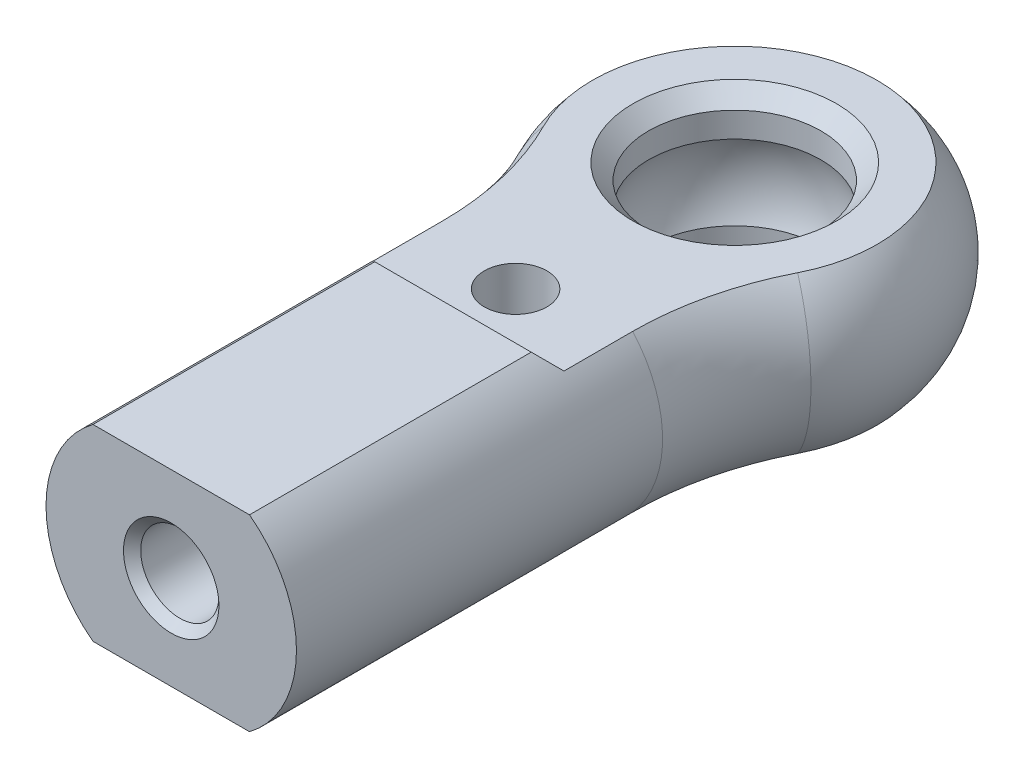
ISO-10303-21;
HEADER;
FILE_DESCRIPTION(('STEP AP214'),'2;1');
FILE_NAME('part.step','',(''),(''),'','','');
FILE_SCHEMA(('AUTOMOTIVE_DESIGN { 1 0 10303 214 1 1 1 1 }'));
ENDSEC;
DATA;
#1=APPLICATION_CONTEXT('core data for automotive mechanical design processes');
#2=APPLICATION_PROTOCOL_DEFINITION('international standard','automotive_design',2000,#1);
#3=PRODUCT_CONTEXT('',#1,'mechanical');
#4=PRODUCT('Part','Part','',(#3));
#5=PRODUCT_RELATED_PRODUCT_CATEGORY('part','',(#4));
#6=PRODUCT_DEFINITION_FORMATION('','',#4);
#7=PRODUCT_DEFINITION_CONTEXT('part definition',#1,'design');
#8=PRODUCT_DEFINITION('design','',#6,#7);
#9=PRODUCT_DEFINITION_SHAPE('','',#8);
#10=(LENGTH_UNIT() NAMED_UNIT(*) SI_UNIT(.MILLI.,.METRE.));
#11=(NAMED_UNIT(*) PLANE_ANGLE_UNIT() SI_UNIT($,.RADIAN.));
#12=(NAMED_UNIT(*) SI_UNIT($,.STERADIAN.) SOLID_ANGLE_UNIT());
#13=UNCERTAINTY_MEASURE_WITH_UNIT(LENGTH_MEASURE(1.E-05),#10,'distance_accuracy_value','');
#14=(GEOMETRIC_REPRESENTATION_CONTEXT(3) GLOBAL_UNCERTAINTY_ASSIGNED_CONTEXT((#13)) GLOBAL_UNIT_ASSIGNED_CONTEXT((#10,
#11,#12)) REPRESENTATION_CONTEXT('',''));
#15=CARTESIAN_POINT('',(0.,0.,0.));
#16=DIRECTION('',(0.,0.,1.));
#17=DIRECTION('',(1.,0.,0.));
#18=AXIS2_PLACEMENT_3D('',#15,#16,#17);
#19=CARTESIAN_POINT('',(-5.5,2.5,8.49999999999999));
#20=DIRECTION('',(0.,-1.,0.));
#21=DIRECTION('',(0.,0.,-1.));
#22=AXIS2_PLACEMENT_3D('',#19,#20,#21);
#23=PLANE('',#22);
#24=CARTESIAN_POINT('',(0.,2.5,0.));
#25=DIRECTION('',(0.,-1.,0.));
#26=DIRECTION('',(0.,0.,-1.));
#27=AXIS2_PLACEMENT_3D('',#24,#25,#26);
#28=CIRCLE('',#27,3.24999999999999);
#29=CARTESIAN_POINT('',(0.,2.5,-3.24999999999999));
#30=VERTEX_POINT('',#29);
#31=EDGE_CURVE('E11',#30,#30,#28,.T.);
#32=ORIENTED_EDGE('',*,*,#31,.T.);
#33=EDGE_LOOP('',(#32));
#34=FACE_BOUND('',#33,.T.);
#35=CARTESIAN_POINT('',(0.,2.5,7.));
#36=DIRECTION('',(0.,-1.,0.));
#37=DIRECTION('',(0.,0.,-1.));
#38=AXIS2_PLACEMENT_3D('',#35,#36,#37);
#39=CIRCLE('',#38,1.);
#40=CARTESIAN_POINT('',(0.,2.5,6.));
#41=VERTEX_POINT('',#40);
#42=EDGE_CURVE('E158',#41,#41,#39,.T.);
#43=ORIENTED_EDGE('',*,*,#42,.T.);
#44=EDGE_LOOP('',(#43));
#45=FACE_BOUND('',#44,.T.);
#46=DIRECTION('',(1.,0.,0.));
#47=VECTOR('',#46,1.);
#48=CARTESIAN_POINT('',(-5.5,2.5,8.49999999999999));
#49=LINE('',#48,#47);
#50=CARTESIAN_POINT('',(-3.04508497187473,2.5,8.49999999999999));
#51=VERTEX_POINT('',#50);
#52=CARTESIAN_POINT('',(3.04508497187474,2.5,8.49999999999999));
#53=VERTEX_POINT('',#52);
#54=EDGE_CURVE('E271',#51,#53,#49,.T.);
#55=ORIENTED_EDGE('',*,*,#54,.T.);
#56=DIRECTION('',(0.,0.,1.));
#57=VECTOR('',#56,1.);
#58=CARTESIAN_POINT('',(3.04508497187474,2.5,6.30476010645924));
#59=LINE('',#58,#57);
#60=CARTESIAN_POINT('',(3.04508497187474,2.5,6.30476010645924));
#61=VERTEX_POINT('',#60);
#62=EDGE_CURVE('E124',#53,#61,#59,.F.);
#63=ORIENTED_EDGE('',*,*,#62,.T.);
#64=CARTESIAN_POINT('',(12.5,2.5,6.30476010645925));
#65=DIRECTION('',(0.,1.,0.));
#66=DIRECTION('',(0.,0.,1.));
#67=AXIS2_PLACEMENT_3D('',#64,#65,#66);
#68=CIRCLE('',#67,9.45491502812527);
#69=CARTESIAN_POINT('',(4.05811158203102,2.5,2.04683360079594));
#70=VERTEX_POINT('',#69);
#71=EDGE_CURVE('E265',#70,#61,#68,.T.);
#72=ORIENTED_EDGE('',*,*,#71,.F.);
#73=CARTESIAN_POINT('',(0.,2.5,0.));
#74=DIRECTION('',(0.,-1.,0.));
#75=DIRECTION('',(0.,0.,-1.));
#76=AXIS2_PLACEMENT_3D('',#73,#74,#75);
#77=CIRCLE('',#76,4.54508497187474);
#78=CARTESIAN_POINT('',(-4.05811158203099,2.5,2.04683360079601));
#79=VERTEX_POINT('',#78);
#80=EDGE_CURVE('E269',#79,#70,#77,.T.);
#81=ORIENTED_EDGE('',*,*,#80,.F.);
#82=CARTESIAN_POINT('',(-12.5,2.5,6.30476010645925));
#83=DIRECTION('',(0.,1.,0.));
#84=DIRECTION('',(0.,0.,1.));
#85=AXIS2_PLACEMENT_3D('',#82,#83,#84);
#86=CIRCLE('',#85,9.45491502812527);
#87=CARTESIAN_POINT('',(-3.04508497187473,2.5,6.30476010645931));
#88=VERTEX_POINT('',#87);
#89=EDGE_CURVE('E277',#88,#79,#86,.T.);
#90=ORIENTED_EDGE('',*,*,#89,.F.);
#91=DIRECTION('',(0.,0.,1.));
#92=VECTOR('',#91,1.);
#93=CARTESIAN_POINT('',(-3.04508497187473,2.5,6.30476010645927));
#94=LINE('',#93,#92);
#95=EDGE_CURVE('E264',#51,#88,#94,.F.);
#96=ORIENTED_EDGE('',*,*,#95,.F.);
#97=EDGE_LOOP('',(#55,#63,#72,#81,#90,#96));
#98=FACE_BOUND('',#97,.T.);
#99=ADVANCED_FACE('F35',(#34,#45,#98),#23,.F.);
#100=CARTESIAN_POINT('',(-5.5,-2.5,8.49999999999999));
#101=DIRECTION('',(0.,-1.,0.));
#102=DIRECTION('',(0.,0.,-1.));
#103=AXIS2_PLACEMENT_3D('',#100,#101,#102);
#104=PLANE('',#103);
#105=CARTESIAN_POINT('',(0.,-2.5,0.));
#106=DIRECTION('',(0.,-1.,0.));
#107=DIRECTION('',(0.,0.,-1.));
#108=AXIS2_PLACEMENT_3D('',#105,#106,#107);
#109=CIRCLE('',#108,3.24999999999999);
#110=CARTESIAN_POINT('',(0.,-2.5,-3.24999999999999));
#111=VERTEX_POINT('',#110);
#112=EDGE_CURVE('E154',#111,#111,#109,.F.);
#113=ORIENTED_EDGE('',*,*,#112,.T.);
#114=EDGE_LOOP('',(#113));
#115=FACE_BOUND('',#114,.T.);
#116=CARTESIAN_POINT('',(0.,-2.5,7.));
#117=DIRECTION('',(0.,-1.,0.));
#118=DIRECTION('',(0.,0.,-1.));
#119=AXIS2_PLACEMENT_3D('',#116,#117,#118);
#120=CIRCLE('',#119,1.);
#121=CARTESIAN_POINT('',(0.,-2.5,6.));
#122=VERTEX_POINT('',#121);
#123=EDGE_CURVE('E155',#122,#122,#120,.T.);
#124=ORIENTED_EDGE('',*,*,#123,.F.);
#125=EDGE_LOOP('',(#124));
#126=FACE_BOUND('',#125,.T.);
#127=DIRECTION('',(0.,0.,1.));
#128=VECTOR('',#127,1.);
#129=CARTESIAN_POINT('',(-3.04508497187473,-2.5,6.30476010645927));
#130=LINE('',#129,#128);
#131=CARTESIAN_POINT('',(-3.04508497187473,-2.5,8.49999999999999));
#132=VERTEX_POINT('',#131);
#133=CARTESIAN_POINT('',(-3.04508497187473,-2.5,6.30476010645931));
#134=VERTEX_POINT('',#133);
#135=EDGE_CURVE('E133',#132,#134,#130,.F.);
#136=ORIENTED_EDGE('',*,*,#135,.T.);
#137=CARTESIAN_POINT('',(-12.5,-2.5,6.30476010645925));
#138=DIRECTION('',(0.,1.,0.));
#139=DIRECTION('',(0.,0.,1.));
#140=AXIS2_PLACEMENT_3D('',#137,#138,#139);
#141=CIRCLE('',#140,9.45491502812527);
#142=CARTESIAN_POINT('',(-4.05811158203099,-2.5,2.04683360079601));
#143=VERTEX_POINT('',#142);
#144=EDGE_CURVE('E298',#134,#143,#141,.T.);
#145=ORIENTED_EDGE('',*,*,#144,.T.);
#146=CARTESIAN_POINT('',(0.,-2.5,0.));
#147=DIRECTION('',(0.,-1.,0.));
#148=DIRECTION('',(0.,0.,-1.));
#149=AXIS2_PLACEMENT_3D('',#146,#147,#148);
#150=CIRCLE('',#149,4.54508497187474);
#151=CARTESIAN_POINT('',(4.05811158203102,-2.5,2.04683360079594));
#152=VERTEX_POINT('',#151);
#153=EDGE_CURVE('E295',#143,#152,#150,.T.);
#154=ORIENTED_EDGE('',*,*,#153,.T.);
#155=CARTESIAN_POINT('',(12.5,-2.5,6.30476010645925));
#156=DIRECTION('',(0.,1.,0.));
#157=DIRECTION('',(0.,0.,1.));
#158=AXIS2_PLACEMENT_3D('',#155,#156,#157);
#159=CIRCLE('',#158,9.45491502812527);
#160=CARTESIAN_POINT('',(3.04508497187474,-2.5,6.30476010645924));
#161=VERTEX_POINT('',#160);
#162=EDGE_CURVE('E134',#152,#161,#159,.T.);
#163=ORIENTED_EDGE('',*,*,#162,.T.);
#164=DIRECTION('',(0.,0.,1.));
#165=VECTOR('',#164,1.);
#166=CARTESIAN_POINT('',(3.04508497187474,-2.5,6.30476010645924));
#167=LINE('',#166,#165);
#168=CARTESIAN_POINT('',(3.04508497187474,-2.5,8.49999999999999));
#169=VERTEX_POINT('',#168);
#170=EDGE_CURVE('E123',#169,#161,#167,.F.);
#171=ORIENTED_EDGE('',*,*,#170,.F.);
#172=DIRECTION('',(1.,0.,0.));
#173=VECTOR('',#172,1.);
#174=CARTESIAN_POINT('',(-5.5,-2.5,8.49999999999999));
#175=LINE('',#174,#173);
#176=EDGE_CURVE('E305',#132,#169,#175,.T.);
#177=ORIENTED_EDGE('',*,*,#176,.F.);
#178=EDGE_LOOP('',(#136,#145,#154,#163,#171,#177));
#179=FACE_BOUND('',#178,.T.);
#180=ADVANCED_FACE('F179',(#115,#126,#179),#104,.T.);
#181=CARTESIAN_POINT('',(-0.249999999999987,0.,6.30476010645927));
#182=DIRECTION('',(0.,0.,1.));
#183=DIRECTION('',(1.,0.,0.));
#184=AXIS2_PLACEMENT_3D('',#181,#182,#183);
#185=CYLINDRICAL_SURFACE('',#184,3.75000000000001);
#186=CARTESIAN_POINT('',(-0.249999999999987,0.,5.99999999999997));
#187=DIRECTION('',(0.,-0.707106781186551,-0.707106781186544));
#188=DIRECTION('',(0.,-0.707106781186544,0.707106781186551));
#189=AXIS2_PLACEMENT_3D('',#186,#187,#188);
#190=ELLIPSE('',#189,5.30330085889915,3.75000000000001);
#191=CARTESIAN_POINT('',(-2.5,-3.,9.));
#192=VERTEX_POINT('',#191);
#193=EDGE_CURVE('E117',#192,#132,#190,.T.);
#194=ORIENTED_EDGE('',*,*,#193,.F.);
#195=DIRECTION('',(0.,0.,1.));
#196=VECTOR('',#195,1.);
#197=CARTESIAN_POINT('',(-2.5,-3.,3.1224989991992));
#198=LINE('',#197,#196);
#199=CARTESIAN_POINT('',(-2.5,-3.,18.));
#200=VERTEX_POINT('',#199);
#201=EDGE_CURVE('E130',#192,#200,#198,.T.);
#202=ORIENTED_EDGE('',*,*,#201,.T.);
#203=CARTESIAN_POINT('',(-0.249999999999988,0.,18.));
#204=DIRECTION('',(0.,0.,-1.));
#205=DIRECTION('',(1.,0.,0.));
#206=AXIS2_PLACEMENT_3D('',#203,#204,#205);
#207=CIRCLE('',#206,3.75000000000001);
#208=CARTESIAN_POINT('',(-2.5,3.,18.));
#209=VERTEX_POINT('',#208);
#210=EDGE_CURVE('E143',#200,#209,#207,.T.);
#211=ORIENTED_EDGE('',*,*,#210,.T.);
#212=DIRECTION('',(0.,0.,1.));
#213=VECTOR('',#212,1.);
#214=CARTESIAN_POINT('',(-2.5,3.,3.1224989991992));
#215=LINE('',#214,#213);
#216=CARTESIAN_POINT('',(-2.5,3.,9.));
#217=VERTEX_POINT('',#216);
#218=EDGE_CURVE('E261',#217,#209,#215,.T.);
#219=ORIENTED_EDGE('',*,*,#218,.F.);
#220=CARTESIAN_POINT('',(-0.249999999999987,0.,5.99999999999997));
#221=DIRECTION('',(0.,-0.707106781186551,0.707106781186544));
#222=DIRECTION('',(0.,0.707106781186544,0.707106781186551));
#223=AXIS2_PLACEMENT_3D('',#220,#221,#222);
#224=ELLIPSE('',#223,5.30330085889915,3.75000000000001);
#225=EDGE_CURVE('E58',#217,#51,#224,.T.);
#226=ORIENTED_EDGE('',*,*,#225,.T.);
#227=ORIENTED_EDGE('',*,*,#95,.T.);
#228=CARTESIAN_POINT('',(-0.249999999999987,0.,6.30476010645927));
#229=DIRECTION('',(0.,0.,-1.));
#230=DIRECTION('',(1.,0.,0.));
#231=AXIS2_PLACEMENT_3D('',#228,#229,#230);
#232=CIRCLE('',#231,3.75000000000001);
#233=EDGE_CURVE('E257',#134,#88,#232,.T.);
#234=ORIENTED_EDGE('',*,*,#233,.F.);
#235=ORIENTED_EDGE('',*,*,#135,.F.);
#236=EDGE_LOOP('',(#194,#202,#211,#219,#226,#227,#234,#235));
#237=FACE_BOUND('',#236,.T.);
#238=ADVANCED_FACE('F128',(#237),#185,.T.);
#239=CARTESIAN_POINT('',(-12.5,0.,6.30476010645925));
#240=DIRECTION('',(0.,-1.,0.));
#241=DIRECTION('',(0.,0.,-1.));
#242=AXIS2_PLACEMENT_3D('',#239,#240,#241);
#243=TOROIDAL_SURFACE('',#242,12.25,3.75000000000001);
#244=ORIENTED_EDGE('',*,*,#144,.F.);
#245=ORIENTED_EDGE('',*,*,#233,.T.);
#246=ORIENTED_EDGE('',*,*,#89,.T.);
#247=CARTESIAN_POINT('',(-1.56249999999998,0.,0.788095013307426));
#248=DIRECTION('',(-0.450340007604243,0.,-0.892857142857137));
#249=DIRECTION('',(0.892857142857137,0.,-0.450340007604243));
#250=AXIS2_PLACEMENT_3D('',#247,#248,#249);
#251=CIRCLE('',#250,3.75000000000001);
#252=EDGE_CURVE('E255',#143,#79,#251,.T.);
#253=ORIENTED_EDGE('',*,*,#252,.F.);
#254=EDGE_LOOP('',(#244,#245,#246,#253));
#255=FACE_BOUND('',#254,.T.);
#256=ADVANCED_FACE('F217',(#255),#243,.T.);
#257=CARTESIAN_POINT('',(0.,0.,0.));
#258=DIRECTION('',(0.,1.,0.));
#259=DIRECTION('',(0.,0.,1.));
#260=AXIS2_PLACEMENT_3D('',#257,#258,#259);
#261=DEGENERATE_TOROIDAL_SURFACE('',#260,1.74999999999999,3.75000000000001,.T.);
#262=ORIENTED_EDGE('',*,*,#153,.F.);
#263=ORIENTED_EDGE('',*,*,#252,.T.);
#264=ORIENTED_EDGE('',*,*,#80,.T.);
#265=CARTESIAN_POINT('',(1.56249999999999,0.,0.788095013307394));
#266=DIRECTION('',(-0.450340007604232,0.,0.892857142857143));
#267=DIRECTION('',(-0.892857142857143,0.,-0.450340007604232));
#268=AXIS2_PLACEMENT_3D('',#265,#266,#267);
#269=CIRCLE('',#268,3.75000000000001);
#270=EDGE_CURVE('E248',#152,#70,#269,.T.);
#271=ORIENTED_EDGE('',*,*,#270,.F.);
#272=EDGE_LOOP('',(#262,#263,#264,#271));
#273=FACE_BOUND('',#272,.T.);
#274=ADVANCED_FACE('F213',(#273),#261,.T.);
#275=CARTESIAN_POINT('',(12.5,0.,6.30476010645925));
#276=DIRECTION('',(0.,-1.,0.));
#277=DIRECTION('',(0.,0.,-1.));
#278=AXIS2_PLACEMENT_3D('',#275,#276,#277);
#279=TOROIDAL_SURFACE('',#278,12.25,3.75000000000001);
#280=ORIENTED_EDGE('',*,*,#162,.F.);
#281=ORIENTED_EDGE('',*,*,#270,.T.);
#282=ORIENTED_EDGE('',*,*,#71,.T.);
#283=CARTESIAN_POINT('',(0.249999999999987,0.,6.30476010645924));
#284=DIRECTION('',(0.,0.,1.));
#285=DIRECTION('',(-1.,0.,0.));
#286=AXIS2_PLACEMENT_3D('',#283,#284,#285);
#287=CIRCLE('',#286,3.75000000000001);
#288=EDGE_CURVE('E245',#161,#61,#287,.T.);
#289=ORIENTED_EDGE('',*,*,#288,.F.);
#290=EDGE_LOOP('',(#280,#281,#282,#289));
#291=FACE_BOUND('',#290,.T.);
#292=ADVANCED_FACE('F209',(#291),#279,.T.);
#293=CARTESIAN_POINT('',(0.249999999999987,0.,6.30476010645924));
#294=DIRECTION('',(0.,0.,1.));
#295=DIRECTION('',(1.,0.,0.));
#296=AXIS2_PLACEMENT_3D('',#293,#294,#295);
#297=CYLINDRICAL_SURFACE('',#296,3.75000000000001);
#298=DIRECTION('',(0.,0.,-1.));
#299=VECTOR('',#298,1.);
#300=CARTESIAN_POINT('',(2.5,-3.,3.1224989991992));
#301=LINE('',#300,#299);
#302=CARTESIAN_POINT('',(2.5,-3.,18.));
#303=VERTEX_POINT('',#302);
#304=CARTESIAN_POINT('',(2.5,-3.,9.));
#305=VERTEX_POINT('',#304);
#306=EDGE_CURVE('E139',#303,#305,#301,.T.);
#307=ORIENTED_EDGE('',*,*,#306,.T.);
#308=CARTESIAN_POINT('',(0.249999999999987,0.,5.99999999999997));
#309=DIRECTION('',(0.,-0.707106781186551,-0.707106781186544));
#310=DIRECTION('',(0.,-0.707106781186544,0.707106781186551));
#311=AXIS2_PLACEMENT_3D('',#308,#309,#310);
#312=ELLIPSE('',#311,5.30330085889915,3.75000000000001);
#313=EDGE_CURVE('E50',#305,#169,#312,.F.);
#314=ORIENTED_EDGE('',*,*,#313,.T.);
#315=ORIENTED_EDGE('',*,*,#170,.T.);
#316=ORIENTED_EDGE('',*,*,#288,.T.);
#317=ORIENTED_EDGE('',*,*,#62,.F.);
#318=CARTESIAN_POINT('',(0.249999999999987,0.,5.99999999999997));
#319=DIRECTION('',(0.,-0.707106781186551,0.707106781186544));
#320=DIRECTION('',(0.,0.707106781186544,0.707106781186551));
#321=AXIS2_PLACEMENT_3D('',#318,#319,#320);
#322=ELLIPSE('',#321,5.30330085889915,3.75000000000001);
#323=CARTESIAN_POINT('',(2.5,3.,9.));
#324=VERTEX_POINT('',#323);
#325=EDGE_CURVE('E266',#324,#53,#322,.F.);
#326=ORIENTED_EDGE('',*,*,#325,.F.);
#327=DIRECTION('',(0.,0.,-1.));
#328=VECTOR('',#327,1.);
#329=CARTESIAN_POINT('',(2.5,3.,3.1224989991992));
#330=LINE('',#329,#328);
#331=CARTESIAN_POINT('',(2.5,3.,18.));
#332=VERTEX_POINT('',#331);
#333=EDGE_CURVE('E141',#332,#324,#330,.T.);
#334=ORIENTED_EDGE('',*,*,#333,.F.);
#335=CARTESIAN_POINT('',(0.249999999999986,0.,18.));
#336=DIRECTION('',(0.,0.,1.));
#337=DIRECTION('',(-1.,0.,0.));
#338=AXIS2_PLACEMENT_3D('',#335,#336,#337);
#339=CIRCLE('',#338,3.75000000000001);
#340=EDGE_CURVE('E241',#303,#332,#339,.T.);
#341=ORIENTED_EDGE('',*,*,#340,.F.);
#342=EDGE_LOOP('',(#307,#314,#315,#316,#317,#326,#334,#341));
#343=FACE_BOUND('',#342,.T.);
#344=ADVANCED_FACE('F206',(#343),#297,.T.);
#345=CARTESIAN_POINT('',(0.,-3.,0.));
#346=DIRECTION('',(0.,1.,0.));
#347=DIRECTION('',(0.,0.,1.));
#348=AXIS2_PLACEMENT_3D('',#345,#346,#347);
#349=PLANE('',#348);
#350=DIRECTION('',(-1.,0.,0.));
#351=VECTOR('',#350,1.);
#352=CARTESIAN_POINT('',(0.,-3.,9.));
#353=LINE('',#352,#351);
#354=EDGE_CURVE('E114',#305,#192,#353,.T.);
#355=ORIENTED_EDGE('',*,*,#354,.F.);
#356=ORIENTED_EDGE('',*,*,#306,.F.);
#357=DIRECTION('',(1.,0.,0.));
#358=VECTOR('',#357,1.);
#359=CARTESIAN_POINT('',(-2.5,-3.,18.));
#360=LINE('',#359,#358);
#361=EDGE_CURVE('E137',#200,#303,#360,.T.);
#362=ORIENTED_EDGE('',*,*,#361,.F.);
#363=ORIENTED_EDGE('',*,*,#201,.F.);
#364=EDGE_LOOP('',(#355,#356,#362,#363));
#365=FACE_BOUND('',#364,.T.);
#366=ADVANCED_FACE('F136',(#365),#349,.F.);
#367=CARTESIAN_POINT('',(-2.5,3.,18.));
#368=DIRECTION('',(0.,0.,-1.));
#369=DIRECTION('',(-1.,0.,0.));
#370=AXIS2_PLACEMENT_3D('',#367,#368,#369);
#371=PLANE('',#370);
#372=CARTESIAN_POINT('',(0.,0.,18.));
#373=DIRECTION('',(0.,0.,1.));
#374=DIRECTION('',(1.,0.,0.));
#375=AXIS2_PLACEMENT_3D('',#372,#373,#374);
#376=CIRCLE('',#375,1.525);
#377=CARTESIAN_POINT('',(1.525,0.,18.));
#378=VERTEX_POINT('',#377);
#379=EDGE_CURVE('E237',#378,#378,#376,.T.);
#380=ORIENTED_EDGE('',*,*,#379,.F.);
#381=EDGE_LOOP('',(#380));
#382=FACE_BOUND('',#381,.T.);
#383=ORIENTED_EDGE('',*,*,#361,.T.);
#384=ORIENTED_EDGE('',*,*,#340,.T.);
#385=DIRECTION('',(1.,0.,0.));
#386=VECTOR('',#385,1.);
#387=CARTESIAN_POINT('',(-2.5,3.,18.));
#388=LINE('',#387,#386);
#389=EDGE_CURVE('E149',#209,#332,#388,.T.);
#390=ORIENTED_EDGE('',*,*,#389,.F.);
#391=ORIENTED_EDGE('',*,*,#210,.F.);
#392=EDGE_LOOP('',(#383,#384,#390,#391));
#393=FACE_BOUND('',#392,.T.);
#394=ADVANCED_FACE('F226',(#382,#393),#371,.F.);
#395=CARTESIAN_POINT('',(0.,3.,0.));
#396=DIRECTION('',(0.,1.,0.));
#397=DIRECTION('',(0.,0.,1.));
#398=AXIS2_PLACEMENT_3D('',#395,#396,#397);
#399=PLANE('',#398);
#400=DIRECTION('',(1.,0.,0.));
#401=VECTOR('',#400,1.);
#402=CARTESIAN_POINT('',(0.,3.,9.));
#403=LINE('',#402,#401);
#404=EDGE_CURVE('E147',#217,#324,#403,.T.);
#405=ORIENTED_EDGE('',*,*,#404,.F.);
#406=ORIENTED_EDGE('',*,*,#218,.T.);
#407=ORIENTED_EDGE('',*,*,#389,.T.);
#408=ORIENTED_EDGE('',*,*,#333,.T.);
#409=EDGE_LOOP('',(#405,#406,#407,#408));
#410=FACE_BOUND('',#409,.T.);
#411=ADVANCED_FACE('F204',(#410),#399,.T.);
#412=CARTESIAN_POINT('',(0.,0.,13.));
#413=DIRECTION('',(0.,0.,1.));
#414=DIRECTION('',(1.,0.,0.));
#415=AXIS2_PLACEMENT_3D('',#412,#413,#414);
#416=CONICAL_SURFACE('',#415,1.25,1.02974425867665);
#417=CARTESIAN_POINT('',(0.,0.,12.2489242262155));
#418=VERTEX_POINT('',#417);
#419=VERTEX_LOOP('',#418);
#420=FACE_BOUND('',#419,.T.);
#421=CARTESIAN_POINT('',(0.,0.,13.));
#422=DIRECTION('',(0.,0.,1.));
#423=DIRECTION('',(1.,0.,0.));
#424=AXIS2_PLACEMENT_3D('',#421,#422,#423);
#425=CIRCLE('',#424,1.25);
#426=CARTESIAN_POINT('',(1.25,0.,13.));
#427=VERTEX_POINT('',#426);
#428=EDGE_CURVE('E246',#427,#427,#425,.T.);
#429=ORIENTED_EDGE('',*,*,#428,.T.);
#430=EDGE_LOOP('',(#429));
#431=FACE_BOUND('',#430,.T.);
#432=ADVANCED_FACE('F200',(#420,#431),#416,.F.);
#433=CARTESIAN_POINT('',(0.,0.,18.));
#434=DIRECTION('',(0.,0.,1.));
#435=DIRECTION('',(1.,0.,0.));
#436=AXIS2_PLACEMENT_3D('',#433,#434,#435);
#437=CYLINDRICAL_SURFACE('',#436,1.25);
#438=ORIENTED_EDGE('',*,*,#428,.F.);
#439=EDGE_LOOP('',(#438));
#440=FACE_BOUND('',#439,.T.);
#441=CARTESIAN_POINT('',(0.,0.,17.725));
#442=DIRECTION('',(0.,0.,1.));
#443=DIRECTION('',(1.,0.,0.));
#444=AXIS2_PLACEMENT_3D('',#441,#442,#443);
#445=CIRCLE('',#444,1.25);
#446=CARTESIAN_POINT('',(1.25,0.,17.725));
#447=VERTEX_POINT('',#446);
#448=EDGE_CURVE('E251',#447,#447,#445,.T.);
#449=ORIENTED_EDGE('',*,*,#448,.T.);
#450=EDGE_LOOP('',(#449));
#451=FACE_BOUND('',#450,.T.);
#452=ADVANCED_FACE('F196',(#440,#451),#437,.F.);
#453=CARTESIAN_POINT('',(0.,0.,18.));
#454=DIRECTION('',(0.,0.,1.));
#455=DIRECTION('',(1.,0.,0.));
#456=AXIS2_PLACEMENT_3D('',#453,#454,#455);
#457=CONICAL_SURFACE('',#456,1.525,0.785398163397442);
#458=ORIENTED_EDGE('',*,*,#448,.F.);
#459=EDGE_LOOP('',(#458));
#460=FACE_BOUND('',#459,.T.);
#461=ORIENTED_EDGE('',*,*,#379,.T.);
#462=EDGE_LOOP('',(#461));
#463=FACE_BOUND('',#462,.T.);
#464=ADVANCED_FACE('F193',(#460,#463),#457,.F.);
#465=CARTESIAN_POINT('',(-5.5,3.,9.));
#466=DIRECTION('',(0.,-0.707106781186551,0.707106781186544));
#467=DIRECTION('',(0.,-0.707106781186544,-0.707106781186551));
#468=AXIS2_PLACEMENT_3D('',#465,#466,#467);
#469=PLANE('',#468);
#470=ORIENTED_EDGE('',*,*,#404,.T.);
#471=ORIENTED_EDGE('',*,*,#325,.T.);
#472=ORIENTED_EDGE('',*,*,#54,.F.);
#473=ORIENTED_EDGE('',*,*,#225,.F.);
#474=EDGE_LOOP('',(#470,#471,#472,#473));
#475=FACE_BOUND('',#474,.T.);
#476=ADVANCED_FACE('F190',(#475),#469,.F.);
#477=CARTESIAN_POINT('',(-5.5,-3.,9.));
#478=DIRECTION('',(0.,-0.707106781186551,-0.707106781186544));
#479=DIRECTION('',(0.,0.707106781186544,-0.707106781186551));
#480=AXIS2_PLACEMENT_3D('',#477,#478,#479);
#481=PLANE('',#480);
#482=ORIENTED_EDGE('',*,*,#193,.T.);
#483=ORIENTED_EDGE('',*,*,#176,.T.);
#484=ORIENTED_EDGE('',*,*,#313,.F.);
#485=ORIENTED_EDGE('',*,*,#354,.T.);
#486=EDGE_LOOP('',(#482,#483,#484,#485));
#487=FACE_BOUND('',#486,.T.);
#488=ADVANCED_FACE('F116',(#487),#481,.T.);
#489=CARTESIAN_POINT('',(0.,6.27757494832792,0.));
#490=DIRECTION('',(0.,1.,0.));
#491=DIRECTION('',(0.,0.,1.));
#492=AXIS2_PLACEMENT_3D('',#489,#490,#491);
#493=CYLINDRICAL_SURFACE('',#492,2.75);
#494=CARTESIAN_POINT('',(0.,2.00000000000001,0.));
#495=DIRECTION('',(0.,-1.,0.));
#496=DIRECTION('',(0.,0.,-1.));
#497=AXIS2_PLACEMENT_3D('',#494,#495,#496);
#498=CIRCLE('',#497,2.75);
#499=CARTESIAN_POINT('',(0.,2.00000000000001,-2.75));
#500=VERTEX_POINT('',#499);
#501=EDGE_CURVE('E43',#500,#500,#498,.F.);
#502=ORIENTED_EDGE('',*,*,#501,.T.);
#503=EDGE_LOOP('',(#502));
#504=FACE_BOUND('',#503,.T.);
#505=CARTESIAN_POINT('',(0.,1.19895788082818,0.));
#506=DIRECTION('',(0.,1.,0.));
#507=DIRECTION('',(0.,0.,1.));
#508=AXIS2_PLACEMENT_3D('',#505,#506,#507);
#509=CIRCLE('',#508,2.75);
#510=CARTESIAN_POINT('',(0.,1.19895788082818,2.75));
#511=VERTEX_POINT('',#510);
#512=EDGE_CURVE('E306',#511,#511,#509,.T.);
#513=ORIENTED_EDGE('',*,*,#512,.F.);
#514=EDGE_LOOP('',(#513));
#515=FACE_BOUND('',#514,.T.);
#516=ADVANCED_FACE('F166',(#504,#515),#493,.F.);
#517=CARTESIAN_POINT('',(0.,0.,0.));
#518=DIRECTION('',(0.,1.,0.));
#519=DIRECTION('',(0.,0.,-1.));
#520=AXIS2_PLACEMENT_3D('',#517,#518,#519);
#521=SPHERICAL_SURFACE('',#520,3.);
#522=ORIENTED_EDGE('',*,*,#512,.T.);
#523=EDGE_LOOP('',(#522));
#524=FACE_BOUND('',#523,.T.);
#525=CARTESIAN_POINT('',(0.,-1.19895788082818,0.));
#526=DIRECTION('',(0.,1.,0.));
#527=DIRECTION('',(0.,0.,1.));
#528=AXIS2_PLACEMENT_3D('',#525,#526,#527);
#529=CIRCLE('',#528,2.75);
#530=CARTESIAN_POINT('',(0.,-1.19895788082818,2.75));
#531=VERTEX_POINT('',#530);
#532=EDGE_CURVE('E312',#531,#531,#529,.T.);
#533=ORIENTED_EDGE('',*,*,#532,.F.);
#534=EDGE_LOOP('',(#533));
#535=FACE_BOUND('',#534,.T.);
#536=ADVANCED_FACE('F325',(#524,#535),#521,.F.);
#537=CARTESIAN_POINT('',(0.,6.27757494832792,0.));
#538=DIRECTION('',(0.,1.,0.));
#539=DIRECTION('',(0.,0.,1.));
#540=AXIS2_PLACEMENT_3D('',#537,#538,#539);
#541=CYLINDRICAL_SURFACE('',#540,2.75);
#542=CARTESIAN_POINT('',(0.,-2.00000000000001,0.));
#543=DIRECTION('',(0.,-1.,0.));
#544=DIRECTION('',(0.,0.,-1.));
#545=AXIS2_PLACEMENT_3D('',#542,#543,#544);
#546=CIRCLE('',#545,2.75);
#547=CARTESIAN_POINT('',(0.,-2.,-2.75));
#548=VERTEX_POINT('',#547);
#549=EDGE_CURVE('E161',#548,#548,#546,.T.);
#550=ORIENTED_EDGE('',*,*,#549,.T.);
#551=EDGE_LOOP('',(#550));
#552=FACE_BOUND('',#551,.T.);
#553=ORIENTED_EDGE('',*,*,#532,.T.);
#554=EDGE_LOOP('',(#553));
#555=FACE_BOUND('',#554,.T.);
#556=ADVANCED_FACE('F319',(#552,#555),#541,.F.);
#557=CARTESIAN_POINT('',(0.,-3.,7.));
#558=DIRECTION('',(0.,1.,0.));
#559=DIRECTION('',(0.,0.,1.));
#560=AXIS2_PLACEMENT_3D('',#557,#558,#559);
#561=CYLINDRICAL_SURFACE('',#560,1.);
#562=ORIENTED_EDGE('',*,*,#123,.T.);
#563=EDGE_LOOP('',(#562));
#564=FACE_BOUND('',#563,.T.);
#565=ORIENTED_EDGE('',*,*,#42,.F.);
#566=EDGE_LOOP('',(#565));
#567=FACE_BOUND('',#566,.T.);
#568=ADVANCED_FACE('F175',(#564,#567),#561,.F.);
#569=CARTESIAN_POINT('',(0.,-2.5,0.));
#570=DIRECTION('',(0.,-1.,0.));
#571=DIRECTION('',(0.,0.,-1.));
#572=AXIS2_PLACEMENT_3D('',#569,#570,#571);
#573=CONICAL_SURFACE('',#572,3.24999999999999,0.785398163397446);
#574=ORIENTED_EDGE('',*,*,#549,.F.);
#575=EDGE_LOOP('',(#574));
#576=FACE_BOUND('',#575,.T.);
#577=ORIENTED_EDGE('',*,*,#112,.F.);
#578=EDGE_LOOP('',(#577));
#579=FACE_BOUND('',#578,.T.);
#580=ADVANCED_FACE('F170',(#576,#579),#573,.F.);
#581=CARTESIAN_POINT('',(0.,2.00000000000001,0.));
#582=DIRECTION('',(0.,1.,0.));
#583=DIRECTION('',(0.,0.,1.));
#584=AXIS2_PLACEMENT_3D('',#581,#582,#583);
#585=CONICAL_SURFACE('',#584,2.75,0.785398163397449);
#586=ORIENTED_EDGE('',*,*,#31,.F.);
#587=EDGE_LOOP('',(#586));
#588=FACE_BOUND('',#587,.T.);
#589=ORIENTED_EDGE('',*,*,#501,.F.);
#590=EDGE_LOOP('',(#589));
#591=FACE_BOUND('',#590,.T.);
#592=ADVANCED_FACE('F37',(#588,#591),#585,.F.);
#593=CLOSED_SHELL('',(#99,#180,#238,#256,#274,#292,#344,#366,#394,#411,#432,#452,#464,#476,#488,
#516,#536,#556,#568,#580,#592));
#594=MANIFOLD_SOLID_BREP('B2',#593);
#595=ADVANCED_BREP_SHAPE_REPRESENTATION('',(#18,#594),#14);
#596=SHAPE_DEFINITION_REPRESENTATION(#9,#595);
ENDSEC;
END-ISO-10303-21;
